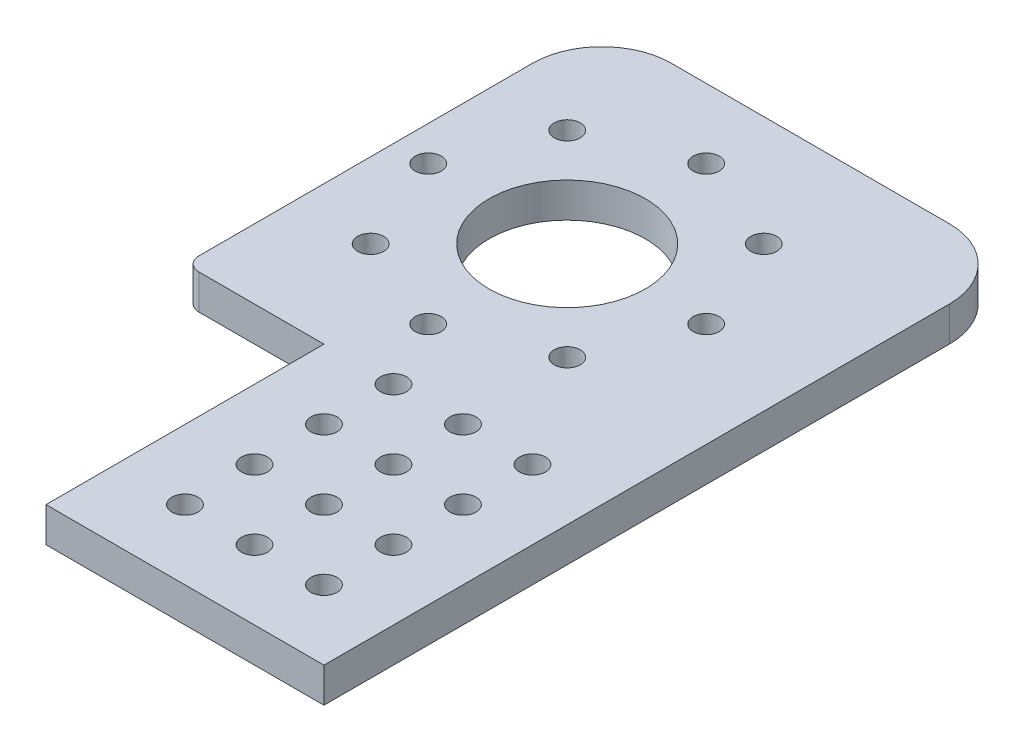
ISO-10303-21;
HEADER;
FILE_DESCRIPTION(('STEP AP214'),'2;1');
FILE_NAME('part.step','',(''),(''),'','','');
FILE_SCHEMA(('AUTOMOTIVE_DESIGN { 1 0 10303 214 1 1 1 1 }'));
ENDSEC;
DATA;
#1=APPLICATION_CONTEXT('core data for automotive mechanical design processes');
#2=APPLICATION_PROTOCOL_DEFINITION('international standard','automotive_design',2000,#1);
#3=PRODUCT_CONTEXT('',#1,'mechanical');
#4=PRODUCT('Part','Part','',(#3));
#5=PRODUCT_RELATED_PRODUCT_CATEGORY('part','',(#4));
#6=PRODUCT_DEFINITION_FORMATION('','',#4);
#7=PRODUCT_DEFINITION_CONTEXT('part definition',#1,'design');
#8=PRODUCT_DEFINITION('design','',#6,#7);
#9=PRODUCT_DEFINITION_SHAPE('','',#8);
#10=(LENGTH_UNIT() NAMED_UNIT(*) SI_UNIT(.MILLI.,.METRE.));
#11=(NAMED_UNIT(*) PLANE_ANGLE_UNIT() SI_UNIT($,.RADIAN.));
#12=(NAMED_UNIT(*) SI_UNIT($,.STERADIAN.) SOLID_ANGLE_UNIT());
#13=UNCERTAINTY_MEASURE_WITH_UNIT(LENGTH_MEASURE(1.E-05),#10,'distance_accuracy_value','');
#14=(GEOMETRIC_REPRESENTATION_CONTEXT(3) GLOBAL_UNCERTAINTY_ASSIGNED_CONTEXT((#13)) GLOBAL_UNIT_ASSIGNED_CONTEXT((#10,
#11,#12)) REPRESENTATION_CONTEXT('',''));
#15=CARTESIAN_POINT('',(0.,0.,0.));
#16=DIRECTION('',(0.,0.,1.));
#17=DIRECTION('',(1.,0.,0.));
#18=AXIS2_PLACEMENT_3D('',#15,#16,#17);
#19=CARTESIAN_POINT('',(0.,6.35,0.));
#20=DIRECTION('',(0.,1.,0.));
#21=DIRECTION('',(0.,0.,1.));
#22=AXIS2_PLACEMENT_3D('',#19,#20,#21);
#23=PLANE('',#22);
#24=CARTESIAN_POINT('',(-19.05,6.35,-88.9));
#25=DIRECTION('',(0.,1.,0.));
#26=DIRECTION('',(0.,0.,1.));
#27=AXIS2_PLACEMENT_3D('',#24,#25,#26);
#28=CIRCLE('',#27,2.38125);
#29=CARTESIAN_POINT('',(-19.05,6.35,-86.51875));
#30=VERTEX_POINT('',#29);
#31=EDGE_CURVE('E386',#30,#30,#28,.T.);
#32=ORIENTED_EDGE('',*,*,#31,.F.);
#33=EDGE_LOOP('',(#32));
#34=FACE_BOUND('',#33,.T.);
#35=CARTESIAN_POINT('',(-11.6105122421383,6.35,-106.860512242139));
#36=DIRECTION('',(0.,1.,0.));
#37=DIRECTION('',(0.,0.,1.));
#38=AXIS2_PLACEMENT_3D('',#35,#36,#37);
#39=CIRCLE('',#38,2.38125);
#40=CARTESIAN_POINT('',(-11.6105122421383,6.35,-104.479262242139));
#41=VERTEX_POINT('',#40);
#42=EDGE_CURVE('E494',#41,#41,#39,.T.);
#43=ORIENTED_EDGE('',*,*,#42,.F.);
#44=EDGE_LOOP('',(#43));
#45=FACE_BOUND('',#44,.T.);
#46=CARTESIAN_POINT('',(6.35000000000009,6.35,-114.3));
#47=DIRECTION('',(0.,1.,0.));
#48=DIRECTION('',(0.,0.,1.));
#49=AXIS2_PLACEMENT_3D('',#46,#47,#48);
#50=CIRCLE('',#49,2.38125);
#51=CARTESIAN_POINT('',(6.35000000000009,6.35,-111.91875));
#52=VERTEX_POINT('',#51);
#53=EDGE_CURVE('E488',#52,#52,#50,.T.);
#54=ORIENTED_EDGE('',*,*,#53,.F.);
#55=EDGE_LOOP('',(#54));
#56=FACE_BOUND('',#55,.T.);
#57=CARTESIAN_POINT('',(24.3105122421384,6.35,-106.860512242138));
#58=DIRECTION('',(0.,1.,0.));
#59=DIRECTION('',(0.,0.,1.));
#60=AXIS2_PLACEMENT_3D('',#57,#58,#59);
#61=CIRCLE('',#60,2.38124999999998);
#62=CARTESIAN_POINT('',(24.3105122421384,6.35,-104.479262242138));
#63=VERTEX_POINT('',#62);
#64=EDGE_CURVE('E482',#63,#63,#61,.T.);
#65=ORIENTED_EDGE('',*,*,#64,.F.);
#66=EDGE_LOOP('',(#65));
#67=FACE_BOUND('',#66,.T.);
#68=CARTESIAN_POINT('',(31.75,6.35,-88.8999999999998));
#69=DIRECTION('',(0.,1.,0.));
#70=DIRECTION('',(0.,0.,1.));
#71=AXIS2_PLACEMENT_3D('',#68,#69,#70);
#72=CIRCLE('',#71,2.38124999999999);
#73=CARTESIAN_POINT('',(31.75,6.35,-86.5187499999998));
#74=VERTEX_POINT('',#73);
#75=EDGE_CURVE('E476',#74,#74,#72,.T.);
#76=ORIENTED_EDGE('',*,*,#75,.F.);
#77=EDGE_LOOP('',(#76));
#78=FACE_BOUND('',#77,.T.);
#79=CARTESIAN_POINT('',(24.3105122421381,6.35,-70.9394877578615));
#80=DIRECTION('',(0.,1.,0.));
#81=DIRECTION('',(0.,0.,1.));
#82=AXIS2_PLACEMENT_3D('',#79,#80,#81);
#83=CIRCLE('',#82,2.38124999999999);
#84=CARTESIAN_POINT('',(24.3105122421381,6.35,-68.5582377578616));
#85=VERTEX_POINT('',#84);
#86=EDGE_CURVE('E470',#85,#85,#83,.T.);
#87=ORIENTED_EDGE('',*,*,#86,.F.);
#88=EDGE_LOOP('',(#87));
#89=FACE_BOUND('',#88,.T.);
#90=CARTESIAN_POINT('',(6.34999999999974,6.35,-63.5));
#91=DIRECTION('',(0.,1.,0.));
#92=DIRECTION('',(0.,0.,1.));
#93=AXIS2_PLACEMENT_3D('',#90,#91,#92);
#94=CIRCLE('',#93,2.38125);
#95=CARTESIAN_POINT('',(6.34999999999974,6.35,-61.11875));
#96=VERTEX_POINT('',#95);
#97=EDGE_CURVE('E464',#96,#96,#94,.T.);
#98=ORIENTED_EDGE('',*,*,#97,.F.);
#99=EDGE_LOOP('',(#98));
#100=FACE_BOUND('',#99,.T.);
#101=CARTESIAN_POINT('',(-11.6105122421385,6.35,-70.9394877578619));
#102=DIRECTION('',(0.,1.,0.));
#103=DIRECTION('',(0.,0.,1.));
#104=AXIS2_PLACEMENT_3D('',#101,#102,#103);
#105=CIRCLE('',#104,2.38125);
#106=CARTESIAN_POINT('',(-11.6105122421385,6.35,-68.5582377578619));
#107=VERTEX_POINT('',#106);
#108=EDGE_CURVE('E458',#107,#107,#105,.T.);
#109=ORIENTED_EDGE('',*,*,#108,.F.);
#110=EDGE_LOOP('',(#109));
#111=FACE_BOUND('',#110,.T.);
#112=CARTESIAN_POINT('',(12.7,6.35,-25.4));
#113=DIRECTION('',(0.,1.,0.));
#114=DIRECTION('',(0.,0.,1.));
#115=AXIS2_PLACEMENT_3D('',#112,#113,#114);
#116=CIRCLE('',#115,2.38125);
#117=CARTESIAN_POINT('',(12.7,6.35,-23.01875));
#118=VERTEX_POINT('',#117);
#119=EDGE_CURVE('E390',#118,#118,#116,.T.);
#120=ORIENTED_EDGE('',*,*,#119,.F.);
#121=EDGE_LOOP('',(#120));
#122=FACE_BOUND('',#121,.T.);
#123=CARTESIAN_POINT('',(25.4,6.35,-50.8));
#124=DIRECTION('',(0.,1.,0.));
#125=DIRECTION('',(0.,0.,1.));
#126=AXIS2_PLACEMENT_3D('',#123,#124,#125);
#127=CIRCLE('',#126,2.38125);
#128=CARTESIAN_POINT('',(25.4,6.35,-48.41875));
#129=VERTEX_POINT('',#128);
#130=EDGE_CURVE('E398',#129,#129,#127,.T.);
#131=ORIENTED_EDGE('',*,*,#130,.F.);
#132=EDGE_LOOP('',(#131));
#133=FACE_BOUND('',#132,.T.);
#134=CARTESIAN_POINT('',(38.1,6.35,-38.1));
#135=DIRECTION('',(0.,1.,0.));
#136=DIRECTION('',(0.,0.,1.));
#137=AXIS2_PLACEMENT_3D('',#134,#135,#136);
#138=CIRCLE('',#137,2.38125);
#139=CARTESIAN_POINT('',(38.1,6.35,-35.71875));
#140=VERTEX_POINT('',#139);
#141=EDGE_CURVE('E406',#140,#140,#138,.T.);
#142=ORIENTED_EDGE('',*,*,#141,.F.);
#143=EDGE_LOOP('',(#142));
#144=FACE_BOUND('',#143,.T.);
#145=CARTESIAN_POINT('',(38.1,6.35,-25.4));
#146=DIRECTION('',(0.,1.,0.));
#147=DIRECTION('',(0.,0.,1.));
#148=AXIS2_PLACEMENT_3D('',#145,#146,#147);
#149=CIRCLE('',#148,2.38125);
#150=CARTESIAN_POINT('',(38.1,6.35,-23.01875));
#151=VERTEX_POINT('',#150);
#152=EDGE_CURVE('E414',#151,#151,#149,.T.);
#153=ORIENTED_EDGE('',*,*,#152,.F.);
#154=EDGE_LOOP('',(#153));
#155=FACE_BOUND('',#154,.T.);
#156=CARTESIAN_POINT('',(38.1,6.35,-12.7));
#157=DIRECTION('',(0.,1.,0.));
#158=DIRECTION('',(0.,0.,1.));
#159=AXIS2_PLACEMENT_3D('',#156,#157,#158);
#160=CIRCLE('',#159,2.38125);
#161=CARTESIAN_POINT('',(38.1,6.35,-10.31875));
#162=VERTEX_POINT('',#161);
#163=EDGE_CURVE('E422',#162,#162,#160,.T.);
#164=ORIENTED_EDGE('',*,*,#163,.F.);
#165=EDGE_LOOP('',(#164));
#166=FACE_BOUND('',#165,.T.);
#167=CARTESIAN_POINT('',(6.35,6.35,-88.9));
#168=DIRECTION('',(0.,1.,0.));
#169=DIRECTION('',(0.,0.,1.));
#170=AXIS2_PLACEMENT_3D('',#167,#168,#169);
#171=CIRCLE('',#170,14.2875);
#172=CARTESIAN_POINT('',(6.35,6.35,-74.6125));
#173=VERTEX_POINT('',#172);
#174=EDGE_CURVE('E313',#173,#173,#171,.T.);
#175=ORIENTED_EDGE('',*,*,#174,.F.);
#176=EDGE_LOOP('',(#175));
#177=FACE_BOUND('',#176,.T.);
#178=DIRECTION('',(0.,0.,1.));
#179=VECTOR('',#178,1.);
#180=CARTESIAN_POINT('',(-25.4,6.35,-127.));
#181=LINE('',#180,#179);
#182=CARTESIAN_POINT('',(-25.4,6.35,-114.3));
#183=VERTEX_POINT('',#182);
#184=CARTESIAN_POINT('',(-25.4,6.35,-53.34));
#185=VERTEX_POINT('',#184);
#186=EDGE_CURVE('E178',#183,#185,#181,.T.);
#187=ORIENTED_EDGE('',*,*,#186,.T.);
#188=CARTESIAN_POINT('',(-22.86,6.35,-53.34));
#189=DIRECTION('',(0.,1.,0.));
#190=DIRECTION('',(0.,0.,1.));
#191=AXIS2_PLACEMENT_3D('',#188,#189,#190);
#192=CIRCLE('',#191,2.54);
#193=CARTESIAN_POINT('',(-22.86,6.35,-50.8));
#194=VERTEX_POINT('',#193);
#195=EDGE_CURVE('E11',#185,#194,#192,.T.);
#196=ORIENTED_EDGE('',*,*,#195,.T.);
#197=DIRECTION('',(1.,0.,0.));
#198=VECTOR('',#197,1.);
#199=CARTESIAN_POINT('',(0.,6.35,-50.8));
#200=LINE('',#199,#198);
#201=CARTESIAN_POINT('',(0.,6.35,-50.8));
#202=VERTEX_POINT('',#201);
#203=EDGE_CURVE('E131',#194,#202,#200,.T.);
#204=ORIENTED_EDGE('',*,*,#203,.T.);
#205=DIRECTION('',(0.,0.,1.));
#206=VECTOR('',#205,1.);
#207=CARTESIAN_POINT('',(0.,6.35,0.));
#208=LINE('',#207,#206);
#209=CARTESIAN_POINT('',(0.,6.35,0.));
#210=VERTEX_POINT('',#209);
#211=EDGE_CURVE('E126',#202,#210,#208,.T.);
#212=ORIENTED_EDGE('',*,*,#211,.T.);
#213=DIRECTION('',(1.,0.,0.));
#214=VECTOR('',#213,1.);
#215=CARTESIAN_POINT('',(0.,6.35,0.));
#216=LINE('',#215,#214);
#217=CARTESIAN_POINT('',(50.8,6.35,0.));
#218=VERTEX_POINT('',#217);
#219=EDGE_CURVE('E114',#210,#218,#216,.T.);
#220=ORIENTED_EDGE('',*,*,#219,.T.);
#221=DIRECTION('',(0.,0.,-1.));
#222=VECTOR('',#221,1.);
#223=CARTESIAN_POINT('',(50.8,6.35,0.));
#224=LINE('',#223,#222);
#225=CARTESIAN_POINT('',(50.8,6.35,-114.3));
#226=VERTEX_POINT('',#225);
#227=EDGE_CURVE('E125',#218,#226,#224,.T.);
#228=ORIENTED_EDGE('',*,*,#227,.T.);
#229=CARTESIAN_POINT('',(38.1,6.35,-114.3));
#230=DIRECTION('',(0.,1.,0.));
#231=DIRECTION('',(0.,0.,1.));
#232=AXIS2_PLACEMENT_3D('',#229,#230,#231);
#233=CIRCLE('',#232,12.7);
#234=CARTESIAN_POINT('',(38.1,6.35,-127.));
#235=VERTEX_POINT('',#234);
#236=EDGE_CURVE('E158',#226,#235,#233,.T.);
#237=ORIENTED_EDGE('',*,*,#236,.T.);
#238=DIRECTION('',(-1.,0.,0.));
#239=VECTOR('',#238,1.);
#240=CARTESIAN_POINT('',(-25.4,6.35,-127.));
#241=LINE('',#240,#239);
#242=CARTESIAN_POINT('',(-12.7,6.35,-127.));
#243=VERTEX_POINT('',#242);
#244=EDGE_CURVE('E180',#235,#243,#241,.T.);
#245=ORIENTED_EDGE('',*,*,#244,.T.);
#246=CARTESIAN_POINT('',(-12.7,6.35,-114.3));
#247=DIRECTION('',(0.,1.,0.));
#248=DIRECTION('',(0.,0.,1.));
#249=AXIS2_PLACEMENT_3D('',#246,#247,#248);
#250=CIRCLE('',#249,12.7);
#251=EDGE_CURVE('E156',#243,#183,#250,.T.);
#252=ORIENTED_EDGE('',*,*,#251,.T.);
#253=EDGE_LOOP('',(#187,#196,#204,#212,#220,#228,#237,#245,#252));
#254=FACE_BOUND('',#253,.T.);
#255=CARTESIAN_POINT('',(12.7,6.35,-12.7));
#256=DIRECTION('',(0.,1.,0.));
#257=DIRECTION('',(0.,0.,1.));
#258=AXIS2_PLACEMENT_3D('',#255,#256,#257);
#259=CIRCLE('',#258,2.38125);
#260=CARTESIAN_POINT('',(12.7,6.35,-10.31875));
#261=VERTEX_POINT('',#260);
#262=EDGE_CURVE('E186',#261,#261,#259,.T.);
#263=ORIENTED_EDGE('',*,*,#262,.F.);
#264=EDGE_LOOP('',(#263));
#265=FACE_BOUND('',#264,.T.);
#266=CARTESIAN_POINT('',(25.4,6.35,-12.7));
#267=DIRECTION('',(0.,1.,0.));
#268=DIRECTION('',(0.,0.,1.));
#269=AXIS2_PLACEMENT_3D('',#266,#267,#268);
#270=CIRCLE('',#269,2.38125);
#271=CARTESIAN_POINT('',(25.4,6.35,-10.31875));
#272=VERTEX_POINT('',#271);
#273=EDGE_CURVE('E318',#272,#272,#270,.T.);
#274=ORIENTED_EDGE('',*,*,#273,.F.);
#275=EDGE_LOOP('',(#274));
#276=FACE_BOUND('',#275,.T.);
#277=CARTESIAN_POINT('',(25.4,6.35,-25.4));
#278=DIRECTION('',(0.,1.,0.));
#279=DIRECTION('',(0.,0.,1.));
#280=AXIS2_PLACEMENT_3D('',#277,#278,#279);
#281=CIRCLE('',#280,2.38125);
#282=CARTESIAN_POINT('',(25.4,6.35,-23.01875));
#283=VERTEX_POINT('',#282);
#284=EDGE_CURVE('E418',#283,#283,#281,.T.);
#285=ORIENTED_EDGE('',*,*,#284,.F.);
#286=EDGE_LOOP('',(#285));
#287=FACE_BOUND('',#286,.T.);
#288=CARTESIAN_POINT('',(25.4,6.35,-38.1));
#289=DIRECTION('',(0.,1.,0.));
#290=DIRECTION('',(0.,0.,1.));
#291=AXIS2_PLACEMENT_3D('',#288,#289,#290);
#292=CIRCLE('',#291,2.38125);
#293=CARTESIAN_POINT('',(25.4,6.35,-35.71875));
#294=VERTEX_POINT('',#293);
#295=EDGE_CURVE('E410',#294,#294,#292,.T.);
#296=ORIENTED_EDGE('',*,*,#295,.F.);
#297=EDGE_LOOP('',(#296));
#298=FACE_BOUND('',#297,.T.);
#299=CARTESIAN_POINT('',(12.7,6.35,-50.8));
#300=DIRECTION('',(0.,1.,0.));
#301=DIRECTION('',(0.,0.,1.));
#302=AXIS2_PLACEMENT_3D('',#299,#300,#301);
#303=CIRCLE('',#302,2.38125);
#304=CARTESIAN_POINT('',(12.7,6.35,-48.41875));
#305=VERTEX_POINT('',#304);
#306=EDGE_CURVE('E402',#305,#305,#303,.T.);
#307=ORIENTED_EDGE('',*,*,#306,.F.);
#308=EDGE_LOOP('',(#307));
#309=FACE_BOUND('',#308,.T.);
#310=CARTESIAN_POINT('',(38.1,6.35,-50.8));
#311=DIRECTION('',(0.,1.,0.));
#312=DIRECTION('',(0.,0.,1.));
#313=AXIS2_PLACEMENT_3D('',#310,#311,#312);
#314=CIRCLE('',#313,2.38125);
#315=CARTESIAN_POINT('',(38.1,6.35,-48.41875));
#316=VERTEX_POINT('',#315);
#317=EDGE_CURVE('E394',#316,#316,#314,.T.);
#318=ORIENTED_EDGE('',*,*,#317,.F.);
#319=EDGE_LOOP('',(#318));
#320=FACE_BOUND('',#319,.T.);
#321=CARTESIAN_POINT('',(12.7,6.35,-38.1));
#322=DIRECTION('',(0.,1.,0.));
#323=DIRECTION('',(0.,0.,1.));
#324=AXIS2_PLACEMENT_3D('',#321,#322,#323);
#325=CIRCLE('',#324,2.38125);
#326=CARTESIAN_POINT('',(12.7,6.35,-35.71875));
#327=VERTEX_POINT('',#326);
#328=EDGE_CURVE('E380',#327,#327,#325,.T.);
#329=ORIENTED_EDGE('',*,*,#328,.F.);
#330=EDGE_LOOP('',(#329));
#331=FACE_BOUND('',#330,.T.);
#332=ADVANCED_FACE('F43',(#34,#45,#56,#67,#78,#89,#100,#111,#122,#133,#144,#155,#166,#177,#254,
#265,#276,#287,#298,#309,#320,#331),#23,.T.);
#333=CARTESIAN_POINT('',(0.,0.,0.));
#334=DIRECTION('',(0.,1.,0.));
#335=DIRECTION('',(0.,0.,1.));
#336=AXIS2_PLACEMENT_3D('',#333,#334,#335);
#337=PLANE('',#336);
#338=CARTESIAN_POINT('',(-19.05,0.,-88.9));
#339=DIRECTION('',(0.,1.,0.));
#340=DIRECTION('',(0.,0.,1.));
#341=AXIS2_PLACEMENT_3D('',#338,#339,#340);
#342=CIRCLE('',#341,2.38125);
#343=CARTESIAN_POINT('',(-19.05,0.,-86.51875));
#344=VERTEX_POINT('',#343);
#345=EDGE_CURVE('E381',#344,#344,#342,.T.);
#346=ORIENTED_EDGE('',*,*,#345,.T.);
#347=EDGE_LOOP('',(#346));
#348=FACE_BOUND('',#347,.T.);
#349=CARTESIAN_POINT('',(-11.6105122421383,0.,-106.860512242139));
#350=DIRECTION('',(0.,1.,0.));
#351=DIRECTION('',(0.,0.,1.));
#352=AXIS2_PLACEMENT_3D('',#349,#350,#351);
#353=CIRCLE('',#352,2.38125);
#354=CARTESIAN_POINT('',(-11.6105122421383,0.,-104.479262242139));
#355=VERTEX_POINT('',#354);
#356=EDGE_CURVE('E491',#355,#355,#353,.T.);
#357=ORIENTED_EDGE('',*,*,#356,.T.);
#358=EDGE_LOOP('',(#357));
#359=FACE_BOUND('',#358,.T.);
#360=CARTESIAN_POINT('',(6.35000000000009,0.,-114.3));
#361=DIRECTION('',(0.,1.,0.));
#362=DIRECTION('',(0.,0.,1.));
#363=AXIS2_PLACEMENT_3D('',#360,#361,#362);
#364=CIRCLE('',#363,2.38125);
#365=CARTESIAN_POINT('',(6.35000000000009,0.,-111.91875));
#366=VERTEX_POINT('',#365);
#367=EDGE_CURVE('E485',#366,#366,#364,.T.);
#368=ORIENTED_EDGE('',*,*,#367,.T.);
#369=EDGE_LOOP('',(#368));
#370=FACE_BOUND('',#369,.T.);
#371=CARTESIAN_POINT('',(24.3105122421384,0.,-106.860512242138));
#372=DIRECTION('',(0.,1.,0.));
#373=DIRECTION('',(0.,0.,1.));
#374=AXIS2_PLACEMENT_3D('',#371,#372,#373);
#375=CIRCLE('',#374,2.38124999999998);
#376=CARTESIAN_POINT('',(24.3105122421384,0.,-104.479262242138));
#377=VERTEX_POINT('',#376);
#378=EDGE_CURVE('E479',#377,#377,#375,.T.);
#379=ORIENTED_EDGE('',*,*,#378,.T.);
#380=EDGE_LOOP('',(#379));
#381=FACE_BOUND('',#380,.T.);
#382=CARTESIAN_POINT('',(31.75,0.,-88.8999999999998));
#383=DIRECTION('',(0.,1.,0.));
#384=DIRECTION('',(0.,0.,1.));
#385=AXIS2_PLACEMENT_3D('',#382,#383,#384);
#386=CIRCLE('',#385,2.38124999999999);
#387=CARTESIAN_POINT('',(31.75,0.,-86.5187499999998));
#388=VERTEX_POINT('',#387);
#389=EDGE_CURVE('E473',#388,#388,#386,.T.);
#390=ORIENTED_EDGE('',*,*,#389,.T.);
#391=EDGE_LOOP('',(#390));
#392=FACE_BOUND('',#391,.T.);
#393=CARTESIAN_POINT('',(24.3105122421381,0.,-70.9394877578615));
#394=DIRECTION('',(0.,1.,0.));
#395=DIRECTION('',(0.,0.,1.));
#396=AXIS2_PLACEMENT_3D('',#393,#394,#395);
#397=CIRCLE('',#396,2.38124999999999);
#398=CARTESIAN_POINT('',(24.3105122421381,0.,-68.5582377578616));
#399=VERTEX_POINT('',#398);
#400=EDGE_CURVE('E467',#399,#399,#397,.T.);
#401=ORIENTED_EDGE('',*,*,#400,.T.);
#402=EDGE_LOOP('',(#401));
#403=FACE_BOUND('',#402,.T.);
#404=CARTESIAN_POINT('',(6.34999999999974,0.,-63.5));
#405=DIRECTION('',(0.,1.,0.));
#406=DIRECTION('',(0.,0.,1.));
#407=AXIS2_PLACEMENT_3D('',#404,#405,#406);
#408=CIRCLE('',#407,2.38125);
#409=CARTESIAN_POINT('',(6.34999999999974,0.,-61.11875));
#410=VERTEX_POINT('',#409);
#411=EDGE_CURVE('E461',#410,#410,#408,.T.);
#412=ORIENTED_EDGE('',*,*,#411,.T.);
#413=EDGE_LOOP('',(#412));
#414=FACE_BOUND('',#413,.T.);
#415=CARTESIAN_POINT('',(-11.6105122421385,0.,-70.9394877578619));
#416=DIRECTION('',(0.,1.,0.));
#417=DIRECTION('',(0.,0.,1.));
#418=AXIS2_PLACEMENT_3D('',#415,#416,#417);
#419=CIRCLE('',#418,2.38125);
#420=CARTESIAN_POINT('',(-11.6105122421385,0.,-68.5582377578619));
#421=VERTEX_POINT('',#420);
#422=EDGE_CURVE('E455',#421,#421,#419,.T.);
#423=ORIENTED_EDGE('',*,*,#422,.T.);
#424=EDGE_LOOP('',(#423));
#425=FACE_BOUND('',#424,.T.);
#426=DIRECTION('',(1.,0.,0.));
#427=VECTOR('',#426,1.);
#428=CARTESIAN_POINT('',(0.,0.,-50.8));
#429=LINE('',#428,#427);
#430=CARTESIAN_POINT('',(-22.86,0.,-50.8));
#431=VERTEX_POINT('',#430);
#432=CARTESIAN_POINT('',(0.,0.,-50.8));
#433=VERTEX_POINT('',#432);
#434=EDGE_CURVE('E135',#431,#433,#429,.T.);
#435=ORIENTED_EDGE('',*,*,#434,.F.);
#436=CARTESIAN_POINT('',(-22.86,0.,-53.34));
#437=DIRECTION('',(0.,1.,0.));
#438=DIRECTION('',(0.,0.,1.));
#439=AXIS2_PLACEMENT_3D('',#436,#437,#438);
#440=CIRCLE('',#439,2.54);
#441=CARTESIAN_POINT('',(-25.4,0.,-53.34));
#442=VERTEX_POINT('',#441);
#443=EDGE_CURVE('E65',#431,#442,#440,.F.);
#444=ORIENTED_EDGE('',*,*,#443,.T.);
#445=DIRECTION('',(0.,0.,1.));
#446=VECTOR('',#445,1.);
#447=CARTESIAN_POINT('',(-25.4,0.,-127.));
#448=LINE('',#447,#446);
#449=CARTESIAN_POINT('',(-25.4,0.,-114.3));
#450=VERTEX_POINT('',#449);
#451=EDGE_CURVE('E173',#450,#442,#448,.T.);
#452=ORIENTED_EDGE('',*,*,#451,.F.);
#453=CARTESIAN_POINT('',(-12.7,0.,-114.3));
#454=DIRECTION('',(0.,1.,0.));
#455=DIRECTION('',(0.,0.,1.));
#456=AXIS2_PLACEMENT_3D('',#453,#454,#455);
#457=CIRCLE('',#456,12.7);
#458=CARTESIAN_POINT('',(-12.7,0.,-127.));
#459=VERTEX_POINT('',#458);
#460=EDGE_CURVE('E150',#450,#459,#457,.F.);
#461=ORIENTED_EDGE('',*,*,#460,.T.);
#462=DIRECTION('',(-1.,0.,0.));
#463=VECTOR('',#462,1.);
#464=CARTESIAN_POINT('',(-25.4,0.,-127.));
#465=LINE('',#464,#463);
#466=CARTESIAN_POINT('',(38.1,0.,-127.));
#467=VERTEX_POINT('',#466);
#468=EDGE_CURVE('E175',#467,#459,#465,.T.);
#469=ORIENTED_EDGE('',*,*,#468,.F.);
#470=CARTESIAN_POINT('',(38.1,0.,-114.3));
#471=DIRECTION('',(0.,1.,0.));
#472=DIRECTION('',(0.,0.,1.));
#473=AXIS2_PLACEMENT_3D('',#470,#471,#472);
#474=CIRCLE('',#473,12.7);
#475=CARTESIAN_POINT('',(50.8,0.,-114.3));
#476=VERTEX_POINT('',#475);
#477=EDGE_CURVE('E152',#467,#476,#474,.F.);
#478=ORIENTED_EDGE('',*,*,#477,.T.);
#479=DIRECTION('',(0.,0.,-1.));
#480=VECTOR('',#479,1.);
#481=CARTESIAN_POINT('',(50.8,0.,0.));
#482=LINE('',#481,#480);
#483=CARTESIAN_POINT('',(50.8,0.,0.));
#484=VERTEX_POINT('',#483);
#485=EDGE_CURVE('E188',#484,#476,#482,.T.);
#486=ORIENTED_EDGE('',*,*,#485,.F.);
#487=DIRECTION('',(1.,0.,0.));
#488=VECTOR('',#487,1.);
#489=CARTESIAN_POINT('',(0.,0.,0.));
#490=LINE('',#489,#488);
#491=CARTESIAN_POINT('',(0.,0.,0.));
#492=VERTEX_POINT('',#491);
#493=EDGE_CURVE('E185',#492,#484,#490,.T.);
#494=ORIENTED_EDGE('',*,*,#493,.F.);
#495=DIRECTION('',(0.,0.,1.));
#496=VECTOR('',#495,1.);
#497=CARTESIAN_POINT('',(0.,0.,0.));
#498=LINE('',#497,#496);
#499=EDGE_CURVE('E139',#433,#492,#498,.T.);
#500=ORIENTED_EDGE('',*,*,#499,.F.);
#501=EDGE_LOOP('',(#435,#444,#452,#461,#469,#478,#486,#494,#500));
#502=FACE_BOUND('',#501,.T.);
#503=CARTESIAN_POINT('',(12.7,0.,-12.7));
#504=DIRECTION('',(0.,1.,0.));
#505=DIRECTION('',(0.,0.,1.));
#506=AXIS2_PLACEMENT_3D('',#503,#504,#505);
#507=CIRCLE('',#506,2.38125);
#508=CARTESIAN_POINT('',(12.7,0.,-10.31875));
#509=VERTEX_POINT('',#508);
#510=EDGE_CURVE('E320',#509,#509,#507,.T.);
#511=ORIENTED_EDGE('',*,*,#510,.T.);
#512=EDGE_LOOP('',(#511));
#513=FACE_BOUND('',#512,.T.);
#514=CARTESIAN_POINT('',(6.35,0.,-88.9));
#515=DIRECTION('',(0.,1.,0.));
#516=DIRECTION('',(0.,0.,1.));
#517=AXIS2_PLACEMENT_3D('',#514,#515,#516);
#518=CIRCLE('',#517,14.2875);
#519=CARTESIAN_POINT('',(6.35,0.,-74.6125));
#520=VERTEX_POINT('',#519);
#521=EDGE_CURVE('E316',#520,#520,#518,.T.);
#522=ORIENTED_EDGE('',*,*,#521,.T.);
#523=EDGE_LOOP('',(#522));
#524=FACE_BOUND('',#523,.T.);
#525=CARTESIAN_POINT('',(25.4,0.,-12.7));
#526=DIRECTION('',(0.,1.,0.));
#527=DIRECTION('',(0.,0.,1.));
#528=AXIS2_PLACEMENT_3D('',#525,#526,#527);
#529=CIRCLE('',#528,2.38125);
#530=CARTESIAN_POINT('',(25.4,0.,-10.31875));
#531=VERTEX_POINT('',#530);
#532=EDGE_CURVE('E323',#531,#531,#529,.T.);
#533=ORIENTED_EDGE('',*,*,#532,.T.);
#534=EDGE_LOOP('',(#533));
#535=FACE_BOUND('',#534,.T.);
#536=CARTESIAN_POINT('',(38.1,0.,-12.7));
#537=DIRECTION('',(0.,1.,0.));
#538=DIRECTION('',(0.,0.,1.));
#539=AXIS2_PLACEMENT_3D('',#536,#537,#538);
#540=CIRCLE('',#539,2.38125);
#541=CARTESIAN_POINT('',(38.1,0.,-10.31875));
#542=VERTEX_POINT('',#541);
#543=EDGE_CURVE('E343',#542,#542,#540,.T.);
#544=ORIENTED_EDGE('',*,*,#543,.T.);
#545=EDGE_LOOP('',(#544));
#546=FACE_BOUND('',#545,.T.);
#547=CARTESIAN_POINT('',(25.4,0.,-25.4));
#548=DIRECTION('',(0.,1.,0.));
#549=DIRECTION('',(0.,0.,1.));
#550=AXIS2_PLACEMENT_3D('',#547,#548,#549);
#551=CIRCLE('',#550,2.38125);
#552=CARTESIAN_POINT('',(25.4,0.,-23.01875));
#553=VERTEX_POINT('',#552);
#554=EDGE_CURVE('E347',#553,#553,#551,.T.);
#555=ORIENTED_EDGE('',*,*,#554,.T.);
#556=EDGE_LOOP('',(#555));
#557=FACE_BOUND('',#556,.T.);
#558=CARTESIAN_POINT('',(38.1,0.,-25.4));
#559=DIRECTION('',(0.,1.,0.));
#560=DIRECTION('',(0.,0.,1.));
#561=AXIS2_PLACEMENT_3D('',#558,#559,#560);
#562=CIRCLE('',#561,2.38125);
#563=CARTESIAN_POINT('',(38.1,0.,-23.01875));
#564=VERTEX_POINT('',#563);
#565=EDGE_CURVE('E351',#564,#564,#562,.T.);
#566=ORIENTED_EDGE('',*,*,#565,.T.);
#567=EDGE_LOOP('',(#566));
#568=FACE_BOUND('',#567,.T.);
#569=CARTESIAN_POINT('',(25.4,0.,-38.1));
#570=DIRECTION('',(0.,1.,0.));
#571=DIRECTION('',(0.,0.,1.));
#572=AXIS2_PLACEMENT_3D('',#569,#570,#571);
#573=CIRCLE('',#572,2.38125);
#574=CARTESIAN_POINT('',(25.4,0.,-35.71875));
#575=VERTEX_POINT('',#574);
#576=EDGE_CURVE('E355',#575,#575,#573,.T.);
#577=ORIENTED_EDGE('',*,*,#576,.T.);
#578=EDGE_LOOP('',(#577));
#579=FACE_BOUND('',#578,.T.);
#580=CARTESIAN_POINT('',(38.1,0.,-38.1));
#581=DIRECTION('',(0.,1.,0.));
#582=DIRECTION('',(0.,0.,1.));
#583=AXIS2_PLACEMENT_3D('',#580,#581,#582);
#584=CIRCLE('',#583,2.38125);
#585=CARTESIAN_POINT('',(38.1,0.,-35.71875));
#586=VERTEX_POINT('',#585);
#587=EDGE_CURVE('E359',#586,#586,#584,.T.);
#588=ORIENTED_EDGE('',*,*,#587,.T.);
#589=EDGE_LOOP('',(#588));
#590=FACE_BOUND('',#589,.T.);
#591=CARTESIAN_POINT('',(12.7,0.,-50.8));
#592=DIRECTION('',(0.,1.,0.));
#593=DIRECTION('',(0.,0.,1.));
#594=AXIS2_PLACEMENT_3D('',#591,#592,#593);
#595=CIRCLE('',#594,2.38125);
#596=CARTESIAN_POINT('',(12.7,0.,-48.41875));
#597=VERTEX_POINT('',#596);
#598=EDGE_CURVE('E363',#597,#597,#595,.T.);
#599=ORIENTED_EDGE('',*,*,#598,.T.);
#600=EDGE_LOOP('',(#599));
#601=FACE_BOUND('',#600,.T.);
#602=CARTESIAN_POINT('',(25.4,0.,-50.8));
#603=DIRECTION('',(0.,1.,0.));
#604=DIRECTION('',(0.,0.,1.));
#605=AXIS2_PLACEMENT_3D('',#602,#603,#604);
#606=CIRCLE('',#605,2.38125);
#607=CARTESIAN_POINT('',(25.4,0.,-48.41875));
#608=VERTEX_POINT('',#607);
#609=EDGE_CURVE('E367',#608,#608,#606,.T.);
#610=ORIENTED_EDGE('',*,*,#609,.T.);
#611=EDGE_LOOP('',(#610));
#612=FACE_BOUND('',#611,.T.);
#613=CARTESIAN_POINT('',(38.1,0.,-50.8));
#614=DIRECTION('',(0.,1.,0.));
#615=DIRECTION('',(0.,0.,1.));
#616=AXIS2_PLACEMENT_3D('',#613,#614,#615);
#617=CIRCLE('',#616,2.38125);
#618=CARTESIAN_POINT('',(38.1,0.,-48.41875));
#619=VERTEX_POINT('',#618);
#620=EDGE_CURVE('E371',#619,#619,#617,.T.);
#621=ORIENTED_EDGE('',*,*,#620,.T.);
#622=EDGE_LOOP('',(#621));
#623=FACE_BOUND('',#622,.T.);
#624=CARTESIAN_POINT('',(12.7,0.,-25.4));
#625=DIRECTION('',(0.,1.,0.));
#626=DIRECTION('',(0.,0.,1.));
#627=AXIS2_PLACEMENT_3D('',#624,#625,#626);
#628=CIRCLE('',#627,2.38125);
#629=CARTESIAN_POINT('',(12.7,0.,-23.01875));
#630=VERTEX_POINT('',#629);
#631=EDGE_CURVE('E375',#630,#630,#628,.T.);
#632=ORIENTED_EDGE('',*,*,#631,.T.);
#633=EDGE_LOOP('',(#632));
#634=FACE_BOUND('',#633,.T.);
#635=CARTESIAN_POINT('',(12.7,0.,-38.1));
#636=DIRECTION('',(0.,1.,0.));
#637=DIRECTION('',(0.,0.,1.));
#638=AXIS2_PLACEMENT_3D('',#635,#636,#637);
#639=CIRCLE('',#638,2.38125);
#640=CARTESIAN_POINT('',(12.7,0.,-35.71875));
#641=VERTEX_POINT('',#640);
#642=EDGE_CURVE('E378',#641,#641,#639,.T.);
#643=ORIENTED_EDGE('',*,*,#642,.T.);
#644=EDGE_LOOP('',(#643));
#645=FACE_BOUND('',#644,.T.);
#646=ADVANCED_FACE('F171',(#348,#359,#370,#381,#392,#403,#414,#425,#502,#513,#524,#535,#546,
#557,#568,#579,#590,#601,#612,#623,#634,#645),#337,.F.);
#647=CARTESIAN_POINT('',(0.,6.35,0.));
#648=DIRECTION('',(1.,0.,0.));
#649=DIRECTION('',(0.,0.,-1.));
#650=AXIS2_PLACEMENT_3D('',#647,#648,#649);
#651=PLANE('',#650);
#652=ORIENTED_EDGE('',*,*,#499,.T.);
#653=DIRECTION('',(0.,-1.,0.));
#654=VECTOR('',#653,1.);
#655=CARTESIAN_POINT('',(0.,6.35,0.));
#656=LINE('',#655,#654);
#657=EDGE_CURVE('E118',#210,#492,#656,.T.);
#658=ORIENTED_EDGE('',*,*,#657,.F.);
#659=ORIENTED_EDGE('',*,*,#211,.F.);
#660=DIRECTION('',(0.,-1.,0.));
#661=VECTOR('',#660,1.);
#662=CARTESIAN_POINT('',(0.,6.35,-50.8));
#663=LINE('',#662,#661);
#664=EDGE_CURVE('E144',#202,#433,#663,.T.);
#665=ORIENTED_EDGE('',*,*,#664,.T.);
#666=EDGE_LOOP('',(#652,#658,#659,#665));
#667=FACE_BOUND('',#666,.T.);
#668=ADVANCED_FACE('F137',(#667),#651,.F.);
#669=CARTESIAN_POINT('',(0.,6.35,0.));
#670=DIRECTION('',(0.,0.,-1.));
#671=DIRECTION('',(-1.,0.,0.));
#672=AXIS2_PLACEMENT_3D('',#669,#670,#671);
#673=PLANE('',#672);
#674=ORIENTED_EDGE('',*,*,#493,.T.);
#675=DIRECTION('',(0.,-1.,0.));
#676=VECTOR('',#675,1.);
#677=CARTESIAN_POINT('',(50.8,6.35,0.));
#678=LINE('',#677,#676);
#679=EDGE_CURVE('E121',#218,#484,#678,.T.);
#680=ORIENTED_EDGE('',*,*,#679,.F.);
#681=ORIENTED_EDGE('',*,*,#219,.F.);
#682=ORIENTED_EDGE('',*,*,#657,.T.);
#683=EDGE_LOOP('',(#674,#680,#681,#682));
#684=FACE_BOUND('',#683,.T.);
#685=ADVANCED_FACE('F116',(#684),#673,.F.);
#686=CARTESIAN_POINT('',(50.8,6.35,0.));
#687=DIRECTION('',(-1.,0.,0.));
#688=DIRECTION('',(0.,0.,1.));
#689=AXIS2_PLACEMENT_3D('',#686,#687,#688);
#690=PLANE('',#689);
#691=ORIENTED_EDGE('',*,*,#485,.T.);
#692=DIRECTION('',(0.,-1.,0.));
#693=VECTOR('',#692,1.);
#694=CARTESIAN_POINT('',(50.8,6.35,-114.3));
#695=LINE('',#694,#693);
#696=EDGE_CURVE('E154',#476,#226,#695,.F.);
#697=ORIENTED_EDGE('',*,*,#696,.T.);
#698=ORIENTED_EDGE('',*,*,#227,.F.);
#699=ORIENTED_EDGE('',*,*,#679,.T.);
#700=EDGE_LOOP('',(#691,#697,#698,#699));
#701=FACE_BOUND('',#700,.T.);
#702=ADVANCED_FACE('F231',(#701),#690,.F.);
#703=CARTESIAN_POINT('',(-25.4,6.35,-127.));
#704=DIRECTION('',(0.,0.,1.));
#705=DIRECTION('',(1.,0.,0.));
#706=AXIS2_PLACEMENT_3D('',#703,#704,#705);
#707=PLANE('',#706);
#708=ORIENTED_EDGE('',*,*,#244,.F.);
#709=DIRECTION('',(0.,-1.,0.));
#710=VECTOR('',#709,1.);
#711=CARTESIAN_POINT('',(38.1,6.35,-127.));
#712=LINE('',#711,#710);
#713=EDGE_CURVE('E142',#235,#467,#712,.T.);
#714=ORIENTED_EDGE('',*,*,#713,.T.);
#715=ORIENTED_EDGE('',*,*,#468,.T.);
#716=DIRECTION('',(0.,-1.,0.));
#717=VECTOR('',#716,1.);
#718=CARTESIAN_POINT('',(-12.7,6.35,-127.));
#719=LINE('',#718,#717);
#720=EDGE_CURVE('E140',#459,#243,#719,.F.);
#721=ORIENTED_EDGE('',*,*,#720,.T.);
#722=EDGE_LOOP('',(#708,#714,#715,#721));
#723=FACE_BOUND('',#722,.T.);
#724=ADVANCED_FACE('F195',(#723),#707,.F.);
#725=CARTESIAN_POINT('',(-25.4,6.35,-127.));
#726=DIRECTION('',(1.,0.,0.));
#727=DIRECTION('',(0.,0.,-1.));
#728=AXIS2_PLACEMENT_3D('',#725,#726,#727);
#729=PLANE('',#728);
#730=ORIENTED_EDGE('',*,*,#451,.T.);
#731=DIRECTION('',(0.,-1.,0.));
#732=VECTOR('',#731,1.);
#733=CARTESIAN_POINT('',(-25.4,6.35,-53.34));
#734=LINE('',#733,#732);
#735=EDGE_CURVE('E51',#442,#185,#734,.F.);
#736=ORIENTED_EDGE('',*,*,#735,.T.);
#737=ORIENTED_EDGE('',*,*,#186,.F.);
#738=DIRECTION('',(0.,-1.,0.));
#739=VECTOR('',#738,1.);
#740=CARTESIAN_POINT('',(-25.4,6.35,-114.3));
#741=LINE('',#740,#739);
#742=EDGE_CURVE('E160',#183,#450,#741,.T.);
#743=ORIENTED_EDGE('',*,*,#742,.T.);
#744=EDGE_LOOP('',(#730,#736,#737,#743));
#745=FACE_BOUND('',#744,.T.);
#746=ADVANCED_FACE('F202',(#745),#729,.F.);
#747=CARTESIAN_POINT('',(0.,6.35,-50.8));
#748=DIRECTION('',(0.,0.,-1.));
#749=DIRECTION('',(-1.,0.,0.));
#750=AXIS2_PLACEMENT_3D('',#747,#748,#749);
#751=PLANE('',#750);
#752=ORIENTED_EDGE('',*,*,#203,.F.);
#753=DIRECTION('',(0.,-1.,0.));
#754=VECTOR('',#753,1.);
#755=CARTESIAN_POINT('',(-22.86,6.35,-50.8));
#756=LINE('',#755,#754);
#757=EDGE_CURVE('E163',#194,#431,#756,.T.);
#758=ORIENTED_EDGE('',*,*,#757,.T.);
#759=ORIENTED_EDGE('',*,*,#434,.T.);
#760=ORIENTED_EDGE('',*,*,#664,.F.);
#761=EDGE_LOOP('',(#752,#758,#759,#760));
#762=FACE_BOUND('',#761,.T.);
#763=ADVANCED_FACE('F168',(#762),#751,.F.);
#764=CARTESIAN_POINT('',(12.7,6.35,-12.7));
#765=DIRECTION('',(0.,-1.,0.));
#766=DIRECTION('',(0.,0.,-1.));
#767=AXIS2_PLACEMENT_3D('',#764,#765,#766);
#768=CYLINDRICAL_SURFACE('',#767,2.38125);
#769=ORIENTED_EDGE('',*,*,#262,.T.);
#770=EDGE_LOOP('',(#769));
#771=FACE_BOUND('',#770,.T.);
#772=ORIENTED_EDGE('',*,*,#510,.F.);
#773=EDGE_LOOP('',(#772));
#774=FACE_BOUND('',#773,.T.);
#775=ADVANCED_FACE('F223',(#771,#774),#768,.F.);
#776=CARTESIAN_POINT('',(6.35,6.35,-88.9));
#777=DIRECTION('',(0.,-1.,0.));
#778=DIRECTION('',(0.,0.,-1.));
#779=AXIS2_PLACEMENT_3D('',#776,#777,#778);
#780=CYLINDRICAL_SURFACE('',#779,14.2875);
#781=ORIENTED_EDGE('',*,*,#174,.T.);
#782=EDGE_LOOP('',(#781));
#783=FACE_BOUND('',#782,.T.);
#784=ORIENTED_EDGE('',*,*,#521,.F.);
#785=EDGE_LOOP('',(#784));
#786=FACE_BOUND('',#785,.T.);
#787=ADVANCED_FACE('F302',(#783,#786),#780,.F.);
#788=CARTESIAN_POINT('',(25.4,6.35,-12.7));
#789=DIRECTION('',(0.,-1.,0.));
#790=DIRECTION('',(0.,0.,-1.));
#791=AXIS2_PLACEMENT_3D('',#788,#789,#790);
#792=CYLINDRICAL_SURFACE('',#791,2.38125);
#793=ORIENTED_EDGE('',*,*,#273,.T.);
#794=EDGE_LOOP('',(#793));
#795=FACE_BOUND('',#794,.T.);
#796=ORIENTED_EDGE('',*,*,#532,.F.);
#797=EDGE_LOOP('',(#796));
#798=FACE_BOUND('',#797,.T.);
#799=ADVANCED_FACE('F299',(#795,#798),#792,.F.);
#800=CARTESIAN_POINT('',(38.1,6.35,-12.7));
#801=DIRECTION('',(0.,-1.,0.));
#802=DIRECTION('',(0.,0.,-1.));
#803=AXIS2_PLACEMENT_3D('',#800,#801,#802);
#804=CYLINDRICAL_SURFACE('',#803,2.38125);
#805=ORIENTED_EDGE('',*,*,#163,.T.);
#806=EDGE_LOOP('',(#805));
#807=FACE_BOUND('',#806,.T.);
#808=ORIENTED_EDGE('',*,*,#543,.F.);
#809=EDGE_LOOP('',(#808));
#810=FACE_BOUND('',#809,.T.);
#811=ADVANCED_FACE('F295',(#807,#810),#804,.F.);
#812=CARTESIAN_POINT('',(25.4,6.35,-25.4));
#813=DIRECTION('',(0.,-1.,0.));
#814=DIRECTION('',(0.,0.,-1.));
#815=AXIS2_PLACEMENT_3D('',#812,#813,#814);
#816=CYLINDRICAL_SURFACE('',#815,2.38125);
#817=ORIENTED_EDGE('',*,*,#284,.T.);
#818=EDGE_LOOP('',(#817));
#819=FACE_BOUND('',#818,.T.);
#820=ORIENTED_EDGE('',*,*,#554,.F.);
#821=EDGE_LOOP('',(#820));
#822=FACE_BOUND('',#821,.T.);
#823=ADVANCED_FACE('F291',(#819,#822),#816,.F.);
#824=CARTESIAN_POINT('',(38.1,6.35,-25.4));
#825=DIRECTION('',(0.,-1.,0.));
#826=DIRECTION('',(0.,0.,-1.));
#827=AXIS2_PLACEMENT_3D('',#824,#825,#826);
#828=CYLINDRICAL_SURFACE('',#827,2.38125);
#829=ORIENTED_EDGE('',*,*,#152,.T.);
#830=EDGE_LOOP('',(#829));
#831=FACE_BOUND('',#830,.T.);
#832=ORIENTED_EDGE('',*,*,#565,.F.);
#833=EDGE_LOOP('',(#832));
#834=FACE_BOUND('',#833,.T.);
#835=ADVANCED_FACE('F287',(#831,#834),#828,.F.);
#836=CARTESIAN_POINT('',(25.4,6.35,-38.1));
#837=DIRECTION('',(0.,-1.,0.));
#838=DIRECTION('',(0.,0.,-1.));
#839=AXIS2_PLACEMENT_3D('',#836,#837,#838);
#840=CYLINDRICAL_SURFACE('',#839,2.38125);
#841=ORIENTED_EDGE('',*,*,#295,.T.);
#842=EDGE_LOOP('',(#841));
#843=FACE_BOUND('',#842,.T.);
#844=ORIENTED_EDGE('',*,*,#576,.F.);
#845=EDGE_LOOP('',(#844));
#846=FACE_BOUND('',#845,.T.);
#847=ADVANCED_FACE('F283',(#843,#846),#840,.F.);
#848=CARTESIAN_POINT('',(38.1,6.35,-38.1));
#849=DIRECTION('',(0.,-1.,0.));
#850=DIRECTION('',(0.,0.,-1.));
#851=AXIS2_PLACEMENT_3D('',#848,#849,#850);
#852=CYLINDRICAL_SURFACE('',#851,2.38125);
#853=ORIENTED_EDGE('',*,*,#141,.T.);
#854=EDGE_LOOP('',(#853));
#855=FACE_BOUND('',#854,.T.);
#856=ORIENTED_EDGE('',*,*,#587,.F.);
#857=EDGE_LOOP('',(#856));
#858=FACE_BOUND('',#857,.T.);
#859=ADVANCED_FACE('F279',(#855,#858),#852,.F.);
#860=CARTESIAN_POINT('',(12.7,6.35,-50.8));
#861=DIRECTION('',(0.,-1.,0.));
#862=DIRECTION('',(0.,0.,-1.));
#863=AXIS2_PLACEMENT_3D('',#860,#861,#862);
#864=CYLINDRICAL_SURFACE('',#863,2.38125);
#865=ORIENTED_EDGE('',*,*,#306,.T.);
#866=EDGE_LOOP('',(#865));
#867=FACE_BOUND('',#866,.T.);
#868=ORIENTED_EDGE('',*,*,#598,.F.);
#869=EDGE_LOOP('',(#868));
#870=FACE_BOUND('',#869,.T.);
#871=ADVANCED_FACE('F275',(#867,#870),#864,.F.);
#872=CARTESIAN_POINT('',(25.4,6.35,-50.8));
#873=DIRECTION('',(0.,-1.,0.));
#874=DIRECTION('',(0.,0.,-1.));
#875=AXIS2_PLACEMENT_3D('',#872,#873,#874);
#876=CYLINDRICAL_SURFACE('',#875,2.38125);
#877=ORIENTED_EDGE('',*,*,#130,.T.);
#878=EDGE_LOOP('',(#877));
#879=FACE_BOUND('',#878,.T.);
#880=ORIENTED_EDGE('',*,*,#609,.F.);
#881=EDGE_LOOP('',(#880));
#882=FACE_BOUND('',#881,.T.);
#883=ADVANCED_FACE('F271',(#879,#882),#876,.F.);
#884=CARTESIAN_POINT('',(38.1,6.35,-50.8));
#885=DIRECTION('',(0.,-1.,0.));
#886=DIRECTION('',(0.,0.,-1.));
#887=AXIS2_PLACEMENT_3D('',#884,#885,#886);
#888=CYLINDRICAL_SURFACE('',#887,2.38125);
#889=ORIENTED_EDGE('',*,*,#317,.T.);
#890=EDGE_LOOP('',(#889));
#891=FACE_BOUND('',#890,.T.);
#892=ORIENTED_EDGE('',*,*,#620,.F.);
#893=EDGE_LOOP('',(#892));
#894=FACE_BOUND('',#893,.T.);
#895=ADVANCED_FACE('F267',(#891,#894),#888,.F.);
#896=CARTESIAN_POINT('',(12.7,6.35,-25.4));
#897=DIRECTION('',(0.,-1.,0.));
#898=DIRECTION('',(0.,0.,-1.));
#899=AXIS2_PLACEMENT_3D('',#896,#897,#898);
#900=CYLINDRICAL_SURFACE('',#899,2.38125);
#901=ORIENTED_EDGE('',*,*,#119,.T.);
#902=EDGE_LOOP('',(#901));
#903=FACE_BOUND('',#902,.T.);
#904=ORIENTED_EDGE('',*,*,#631,.F.);
#905=EDGE_LOOP('',(#904));
#906=FACE_BOUND('',#905,.T.);
#907=ADVANCED_FACE('F263',(#903,#906),#900,.F.);
#908=CARTESIAN_POINT('',(12.7,6.35,-38.1));
#909=DIRECTION('',(0.,-1.,0.));
#910=DIRECTION('',(0.,0.,-1.));
#911=AXIS2_PLACEMENT_3D('',#908,#909,#910);
#912=CYLINDRICAL_SURFACE('',#911,2.38125);
#913=ORIENTED_EDGE('',*,*,#328,.T.);
#914=EDGE_LOOP('',(#913));
#915=FACE_BOUND('',#914,.T.);
#916=ORIENTED_EDGE('',*,*,#642,.F.);
#917=EDGE_LOOP('',(#916));
#918=FACE_BOUND('',#917,.T.);
#919=ADVANCED_FACE('F241',(#915,#918),#912,.F.);
#920=CARTESIAN_POINT('',(38.1,6.35,-114.3));
#921=DIRECTION('',(0.,-1.,0.));
#922=DIRECTION('',(0.,0.,-1.));
#923=AXIS2_PLACEMENT_3D('',#920,#921,#922);
#924=CYLINDRICAL_SURFACE('',#923,12.7);
#925=ORIENTED_EDGE('',*,*,#236,.F.);
#926=ORIENTED_EDGE('',*,*,#696,.F.);
#927=ORIENTED_EDGE('',*,*,#477,.F.);
#928=ORIENTED_EDGE('',*,*,#713,.F.);
#929=EDGE_LOOP('',(#925,#926,#927,#928));
#930=FACE_BOUND('',#929,.T.);
#931=ADVANCED_FACE('F239',(#930),#924,.T.);
#932=CARTESIAN_POINT('',(-12.7,6.35,-114.3));
#933=DIRECTION('',(0.,-1.,0.));
#934=DIRECTION('',(0.,0.,-1.));
#935=AXIS2_PLACEMENT_3D('',#932,#933,#934);
#936=CYLINDRICAL_SURFACE('',#935,12.7);
#937=ORIENTED_EDGE('',*,*,#251,.F.);
#938=ORIENTED_EDGE('',*,*,#720,.F.);
#939=ORIENTED_EDGE('',*,*,#460,.F.);
#940=ORIENTED_EDGE('',*,*,#742,.F.);
#941=EDGE_LOOP('',(#937,#938,#939,#940));
#942=FACE_BOUND('',#941,.T.);
#943=ADVANCED_FACE('F200',(#942),#936,.T.);
#944=CARTESIAN_POINT('',(-11.6105122421385,0.,-70.9394877578619));
#945=DIRECTION('',(0.,1.,0.));
#946=DIRECTION('',(0.,0.,1.));
#947=AXIS2_PLACEMENT_3D('',#944,#945,#946);
#948=CYLINDRICAL_SURFACE('',#947,2.38125);
#949=ORIENTED_EDGE('',*,*,#422,.F.);
#950=EDGE_LOOP('',(#949));
#951=FACE_BOUND('',#950,.T.);
#952=ORIENTED_EDGE('',*,*,#108,.T.);
#953=EDGE_LOOP('',(#952));
#954=FACE_BOUND('',#953,.T.);
#955=ADVANCED_FACE('F244',(#951,#954),#948,.F.);
#956=CARTESIAN_POINT('',(6.34999999999974,0.,-63.5));
#957=DIRECTION('',(0.,1.,0.));
#958=DIRECTION('',(0.,0.,1.));
#959=AXIS2_PLACEMENT_3D('',#956,#957,#958);
#960=CYLINDRICAL_SURFACE('',#959,2.38125);
#961=ORIENTED_EDGE('',*,*,#411,.F.);
#962=EDGE_LOOP('',(#961));
#963=FACE_BOUND('',#962,.T.);
#964=ORIENTED_EDGE('',*,*,#97,.T.);
#965=EDGE_LOOP('',(#964));
#966=FACE_BOUND('',#965,.T.);
#967=ADVANCED_FACE('F248',(#963,#966),#960,.F.);
#968=CARTESIAN_POINT('',(24.3105122421381,0.,-70.9394877578615));
#969=DIRECTION('',(0.,1.,0.));
#970=DIRECTION('',(0.,0.,1.));
#971=AXIS2_PLACEMENT_3D('',#968,#969,#970);
#972=CYLINDRICAL_SURFACE('',#971,2.38124999999999);
#973=ORIENTED_EDGE('',*,*,#400,.F.);
#974=EDGE_LOOP('',(#973));
#975=FACE_BOUND('',#974,.T.);
#976=ORIENTED_EDGE('',*,*,#86,.T.);
#977=EDGE_LOOP('',(#976));
#978=FACE_BOUND('',#977,.T.);
#979=ADVANCED_FACE('F254',(#975,#978),#972,.F.);
#980=CARTESIAN_POINT('',(31.75,0.,-88.8999999999998));
#981=DIRECTION('',(0.,1.,0.));
#982=DIRECTION('',(0.,0.,1.));
#983=AXIS2_PLACEMENT_3D('',#980,#981,#982);
#984=CYLINDRICAL_SURFACE('',#983,2.38124999999999);
#985=ORIENTED_EDGE('',*,*,#389,.F.);
#986=EDGE_LOOP('',(#985));
#987=FACE_BOUND('',#986,.T.);
#988=ORIENTED_EDGE('',*,*,#75,.T.);
#989=EDGE_LOOP('',(#988));
#990=FACE_BOUND('',#989,.T.);
#991=ADVANCED_FACE('F516',(#987,#990),#984,.F.);
#992=CARTESIAN_POINT('',(24.3105122421384,0.,-106.860512242138));
#993=DIRECTION('',(0.,1.,0.));
#994=DIRECTION('',(0.,0.,1.));
#995=AXIS2_PLACEMENT_3D('',#992,#993,#994);
#996=CYLINDRICAL_SURFACE('',#995,2.38124999999998);
#997=ORIENTED_EDGE('',*,*,#378,.F.);
#998=EDGE_LOOP('',(#997));
#999=FACE_BOUND('',#998,.T.);
#1000=ORIENTED_EDGE('',*,*,#64,.T.);
#1001=EDGE_LOOP('',(#1000));
#1002=FACE_BOUND('',#1001,.T.);
#1003=ADVANCED_FACE('F521',(#999,#1002),#996,.F.);
#1004=CARTESIAN_POINT('',(6.35000000000009,0.,-114.3));
#1005=DIRECTION('',(0.,1.,0.));
#1006=DIRECTION('',(0.,0.,1.));
#1007=AXIS2_PLACEMENT_3D('',#1004,#1005,#1006);
#1008=CYLINDRICAL_SURFACE('',#1007,2.38125);
#1009=ORIENTED_EDGE('',*,*,#367,.F.);
#1010=EDGE_LOOP('',(#1009));
#1011=FACE_BOUND('',#1010,.T.);
#1012=ORIENTED_EDGE('',*,*,#53,.T.);
#1013=EDGE_LOOP('',(#1012));
#1014=FACE_BOUND('',#1013,.T.);
#1015=ADVANCED_FACE('F528',(#1011,#1014),#1008,.F.);
#1016=CARTESIAN_POINT('',(-11.6105122421383,0.,-106.860512242139));
#1017=DIRECTION('',(0.,1.,0.));
#1018=DIRECTION('',(0.,0.,1.));
#1019=AXIS2_PLACEMENT_3D('',#1016,#1017,#1018);
#1020=CYLINDRICAL_SURFACE('',#1019,2.38125);
#1021=ORIENTED_EDGE('',*,*,#356,.F.);
#1022=EDGE_LOOP('',(#1021));
#1023=FACE_BOUND('',#1022,.T.);
#1024=ORIENTED_EDGE('',*,*,#42,.T.);
#1025=EDGE_LOOP('',(#1024));
#1026=FACE_BOUND('',#1025,.T.);
#1027=ADVANCED_FACE('F209',(#1023,#1026),#1020,.F.);
#1028=CARTESIAN_POINT('',(-19.05,0.,-88.9));
#1029=DIRECTION('',(0.,1.,0.));
#1030=DIRECTION('',(0.,0.,1.));
#1031=AXIS2_PLACEMENT_3D('',#1028,#1029,#1030);
#1032=CYLINDRICAL_SURFACE('',#1031,2.38125);
#1033=ORIENTED_EDGE('',*,*,#345,.F.);
#1034=EDGE_LOOP('',(#1033));
#1035=FACE_BOUND('',#1034,.T.);
#1036=ORIENTED_EDGE('',*,*,#31,.T.);
#1037=EDGE_LOOP('',(#1036));
#1038=FACE_BOUND('',#1037,.T.);
#1039=ADVANCED_FACE('F204',(#1035,#1038),#1032,.F.);
#1040=CARTESIAN_POINT('',(-22.86,6.35,-53.34));
#1041=DIRECTION('',(0.,-1.,0.));
#1042=DIRECTION('',(0.,0.,-1.));
#1043=AXIS2_PLACEMENT_3D('',#1040,#1041,#1042);
#1044=CYLINDRICAL_SURFACE('',#1043,2.54);
#1045=ORIENTED_EDGE('',*,*,#195,.F.);
#1046=ORIENTED_EDGE('',*,*,#735,.F.);
#1047=ORIENTED_EDGE('',*,*,#443,.F.);
#1048=ORIENTED_EDGE('',*,*,#757,.F.);
#1049=EDGE_LOOP('',(#1045,#1046,#1047,#1048));
#1050=FACE_BOUND('',#1049,.T.);
#1051=ADVANCED_FACE('F45',(#1050),#1044,.T.);
#1052=CLOSED_SHELL('',(#332,#646,#668,#685,#702,#724,#746,#763,#775,#787,#799,#811,#823,#835,
#847,#859,#871,#883,#895,#907,#919,#931,#943,#955,#967,#979,#991,#1003,#1015,#1027,#1039,#1051));
#1053=MANIFOLD_SOLID_BREP('B2',#1052);
#1054=ADVANCED_BREP_SHAPE_REPRESENTATION('',(#18,#1053),#14);
#1055=SHAPE_DEFINITION_REPRESENTATION(#9,#1054);
ENDSEC;
END-ISO-10303-21;
